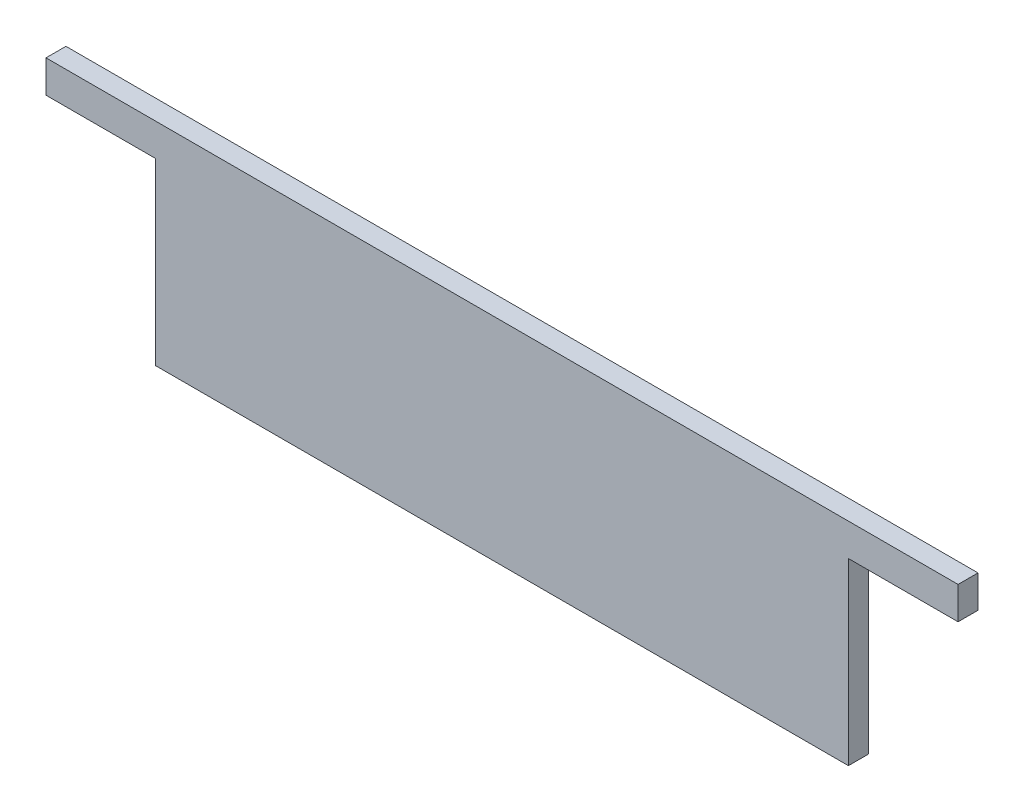
ISO-10303-21;
HEADER;
FILE_DESCRIPTION(('STEP AP214'),'2;1');
FILE_NAME('part.step','',(''),(''),'','','');
FILE_SCHEMA(('AUTOMOTIVE_DESIGN { 1 0 10303 214 1 1 1 1 }'));
ENDSEC;
DATA;
#1=APPLICATION_CONTEXT('core data for automotive mechanical design processes');
#2=APPLICATION_PROTOCOL_DEFINITION('international standard','automotive_design',2000,#1);
#3=PRODUCT_CONTEXT('',#1,'mechanical');
#4=PRODUCT('Part','Part','',(#3));
#5=PRODUCT_RELATED_PRODUCT_CATEGORY('part','',(#4));
#6=PRODUCT_DEFINITION_FORMATION('','',#4);
#7=PRODUCT_DEFINITION_CONTEXT('part definition',#1,'design');
#8=PRODUCT_DEFINITION('design','',#6,#7);
#9=PRODUCT_DEFINITION_SHAPE('','',#8);
#10=(LENGTH_UNIT() NAMED_UNIT(*) SI_UNIT(.MILLI.,.METRE.));
#11=(NAMED_UNIT(*) PLANE_ANGLE_UNIT() SI_UNIT($,.RADIAN.));
#12=(NAMED_UNIT(*) SI_UNIT($,.STERADIAN.) SOLID_ANGLE_UNIT());
#13=UNCERTAINTY_MEASURE_WITH_UNIT(LENGTH_MEASURE(1.E-05),#10,'distance_accuracy_value','');
#14=(GEOMETRIC_REPRESENTATION_CONTEXT(3) GLOBAL_UNCERTAINTY_ASSIGNED_CONTEXT((#13)) GLOBAL_UNIT_ASSIGNED_CONTEXT((#10,
#11,#12)) REPRESENTATION_CONTEXT('',''));
#15=CARTESIAN_POINT('',(0.,0.,0.));
#16=DIRECTION('',(0.,0.,1.));
#17=DIRECTION('',(1.,0.,0.));
#18=AXIS2_PLACEMENT_3D('',#15,#16,#17);
#19=CARTESIAN_POINT('',(0.,134.9375,0.));
#20=DIRECTION('',(0.,0.,1.));
#21=DIRECTION('',(1.,0.,0.));
#22=AXIS2_PLACEMENT_3D('',#19,#20,#21);
#23=PLANE('',#22);
#24=DIRECTION('',(1.,0.,0.));
#25=VECTOR('',#24,1.);
#26=CARTESIAN_POINT('',(0.,0.,0.));
#27=LINE('',#26,#25);
#28=CARTESIAN_POINT('',(511.175,0.,0.));
#29=VERTEX_POINT('',#28);
#30=CARTESIAN_POINT('',(69.85,0.,0.));
#31=VERTEX_POINT('',#30);
#32=EDGE_CURVE('E20',#29,#31,#27,.F.);
#33=ORIENTED_EDGE('',*,*,#32,.F.);
#34=DIRECTION('',(0.,1.,0.));
#35=VECTOR('',#34,1.);
#36=CARTESIAN_POINT('',(511.175,0.,0.));
#37=LINE('',#36,#35);
#38=CARTESIAN_POINT('',(511.175,114.3,0.));
#39=VERTEX_POINT('',#38);
#40=EDGE_CURVE('E124',#29,#39,#37,.T.);
#41=ORIENTED_EDGE('',*,*,#40,.T.);
#42=DIRECTION('',(1.,0.,0.));
#43=VECTOR('',#42,1.);
#44=CARTESIAN_POINT('',(511.175,114.3,0.));
#45=LINE('',#44,#43);
#46=CARTESIAN_POINT('',(581.025,114.3,0.));
#47=VERTEX_POINT('',#46);
#48=EDGE_CURVE('E119',#39,#47,#45,.T.);
#49=ORIENTED_EDGE('',*,*,#48,.T.);
#50=DIRECTION('',(0.,1.,0.));
#51=VECTOR('',#50,1.);
#52=CARTESIAN_POINT('',(581.025,0.,0.));
#53=LINE('',#52,#51);
#54=CARTESIAN_POINT('',(581.025,134.9375,0.));
#55=VERTEX_POINT('',#54);
#56=EDGE_CURVE('E116',#55,#47,#53,.F.);
#57=ORIENTED_EDGE('',*,*,#56,.F.);
#58=DIRECTION('',(1.,0.,0.));
#59=VECTOR('',#58,1.);
#60=CARTESIAN_POINT('',(0.,134.9375,0.));
#61=LINE('',#60,#59);
#62=CARTESIAN_POINT('',(0.,134.9375,0.));
#63=VERTEX_POINT('',#62);
#64=EDGE_CURVE('E108',#63,#55,#61,.T.);
#65=ORIENTED_EDGE('',*,*,#64,.F.);
#66=DIRECTION('',(0.,1.,0.));
#67=VECTOR('',#66,1.);
#68=CARTESIAN_POINT('',(0.,0.,0.));
#69=LINE('',#68,#67);
#70=CARTESIAN_POINT('',(0.,114.3,0.));
#71=VERTEX_POINT('',#70);
#72=EDGE_CURVE('E106',#63,#71,#69,.F.);
#73=ORIENTED_EDGE('',*,*,#72,.T.);
#74=DIRECTION('',(1.,0.,0.));
#75=VECTOR('',#74,1.);
#76=CARTESIAN_POINT('',(0.,114.3,0.));
#77=LINE('',#76,#75);
#78=CARTESIAN_POINT('',(69.85,114.3,0.));
#79=VERTEX_POINT('',#78);
#80=EDGE_CURVE('E80',#71,#79,#77,.T.);
#81=ORIENTED_EDGE('',*,*,#80,.T.);
#82=DIRECTION('',(0.,1.,0.));
#83=VECTOR('',#82,1.);
#84=CARTESIAN_POINT('',(69.85,114.3,0.));
#85=LINE('',#84,#83);
#86=EDGE_CURVE('E92',#79,#31,#85,.F.);
#87=ORIENTED_EDGE('',*,*,#86,.T.);
#88=EDGE_LOOP('',(#33,#41,#49,#57,#65,#73,#81,#87));
#89=FACE_BOUND('',#88,.T.);
#90=ADVANCED_FACE('F17',(#89),#23,.T.);
#91=CARTESIAN_POINT('',(0.,0.,0.));
#92=DIRECTION('',(0.,-1.,0.));
#93=DIRECTION('',(0.,0.,-1.));
#94=AXIS2_PLACEMENT_3D('',#91,#92,#93);
#95=PLANE('',#94);
#96=DIRECTION('',(-1.,0.,0.));
#97=VECTOR('',#96,1.);
#98=CARTESIAN_POINT('',(0.,0.,-12.7));
#99=LINE('',#98,#97);
#100=CARTESIAN_POINT('',(511.175,0.,-12.7));
#101=VERTEX_POINT('',#100);
#102=CARTESIAN_POINT('',(69.85,0.,-12.7));
#103=VERTEX_POINT('',#102);
#104=EDGE_CURVE('E127',#101,#103,#99,.T.);
#105=ORIENTED_EDGE('',*,*,#104,.F.);
#106=DIRECTION('',(0.,0.,1.));
#107=VECTOR('',#106,1.);
#108=CARTESIAN_POINT('',(511.175,0.,-12.7));
#109=LINE('',#108,#107);
#110=EDGE_CURVE('E90',#101,#29,#109,.T.);
#111=ORIENTED_EDGE('',*,*,#110,.T.);
#112=ORIENTED_EDGE('',*,*,#32,.T.);
#113=DIRECTION('',(0.,0.,-1.));
#114=VECTOR('',#113,1.);
#115=CARTESIAN_POINT('',(69.85,0.,-12.7));
#116=LINE('',#115,#114);
#117=EDGE_CURVE('E87',#31,#103,#116,.T.);
#118=ORIENTED_EDGE('',*,*,#117,.T.);
#119=EDGE_LOOP('',(#105,#111,#112,#118));
#120=FACE_BOUND('',#119,.T.);
#121=ADVANCED_FACE('F85',(#120),#95,.T.);
#122=CARTESIAN_POINT('',(69.85,114.3,-12.7));
#123=DIRECTION('',(1.,0.,0.));
#124=DIRECTION('',(0.,0.,-1.));
#125=AXIS2_PLACEMENT_3D('',#122,#123,#124);
#126=PLANE('',#125);
#127=DIRECTION('',(0.,0.,1.));
#128=VECTOR('',#127,1.);
#129=CARTESIAN_POINT('',(69.85,114.3,-12.7));
#130=LINE('',#129,#128);
#131=CARTESIAN_POINT('',(69.85,114.3,-12.7));
#132=VERTEX_POINT('',#131);
#133=EDGE_CURVE('E102',#79,#132,#130,.F.);
#134=ORIENTED_EDGE('',*,*,#133,.T.);
#135=DIRECTION('',(0.,1.,0.));
#136=VECTOR('',#135,1.);
#137=CARTESIAN_POINT('',(69.85,0.,-12.7));
#138=LINE('',#137,#136);
#139=EDGE_CURVE('E98',#103,#132,#138,.T.);
#140=ORIENTED_EDGE('',*,*,#139,.F.);
#141=ORIENTED_EDGE('',*,*,#117,.F.);
#142=ORIENTED_EDGE('',*,*,#86,.F.);
#143=EDGE_LOOP('',(#134,#140,#141,#142));
#144=FACE_BOUND('',#143,.T.);
#145=ADVANCED_FACE('F96',(#144),#126,.F.);
#146=CARTESIAN_POINT('',(0.,114.3,-12.7));
#147=DIRECTION('',(0.,1.,0.));
#148=DIRECTION('',(0.,0.,1.));
#149=AXIS2_PLACEMENT_3D('',#146,#147,#148);
#150=PLANE('',#149);
#151=ORIENTED_EDGE('',*,*,#80,.F.);
#152=DIRECTION('',(0.,0.,-1.));
#153=VECTOR('',#152,1.);
#154=CARTESIAN_POINT('',(0.,114.3,0.));
#155=LINE('',#154,#153);
#156=CARTESIAN_POINT('',(0.,114.3,-12.7));
#157=VERTEX_POINT('',#156);
#158=EDGE_CURVE('E104',#71,#157,#155,.T.);
#159=ORIENTED_EDGE('',*,*,#158,.T.);
#160=DIRECTION('',(-1.,0.,0.));
#161=VECTOR('',#160,1.);
#162=CARTESIAN_POINT('',(0.,114.3,-12.7));
#163=LINE('',#162,#161);
#164=EDGE_CURVE('E130',#132,#157,#163,.T.);
#165=ORIENTED_EDGE('',*,*,#164,.F.);
#166=ORIENTED_EDGE('',*,*,#133,.F.);
#167=EDGE_LOOP('',(#151,#159,#165,#166));
#168=FACE_BOUND('',#167,.T.);
#169=ADVANCED_FACE('F173',(#168),#150,.F.);
#170=CARTESIAN_POINT('',(0.,0.,0.));
#171=DIRECTION('',(1.,0.,0.));
#172=DIRECTION('',(0.,0.,-1.));
#173=AXIS2_PLACEMENT_3D('',#170,#171,#172);
#174=PLANE('',#173);
#175=DIRECTION('',(0.,0.,1.));
#176=VECTOR('',#175,1.);
#177=CARTESIAN_POINT('',(0.,134.9375,-12.7));
#178=LINE('',#177,#176);
#179=CARTESIAN_POINT('',(0.,134.9375,-12.7));
#180=VERTEX_POINT('',#179);
#181=EDGE_CURVE('E110',#180,#63,#178,.T.);
#182=ORIENTED_EDGE('',*,*,#181,.F.);
#183=DIRECTION('',(0.,1.,0.));
#184=VECTOR('',#183,1.);
#185=CARTESIAN_POINT('',(0.,0.,-12.7));
#186=LINE('',#185,#184);
#187=EDGE_CURVE('E133',#157,#180,#186,.T.);
#188=ORIENTED_EDGE('',*,*,#187,.F.);
#189=ORIENTED_EDGE('',*,*,#158,.F.);
#190=ORIENTED_EDGE('',*,*,#72,.F.);
#191=EDGE_LOOP('',(#182,#188,#189,#190));
#192=FACE_BOUND('',#191,.T.);
#193=ADVANCED_FACE('F169',(#192),#174,.F.);
#194=CARTESIAN_POINT('',(0.,134.9375,-12.7));
#195=DIRECTION('',(0.,1.,0.));
#196=DIRECTION('',(0.,0.,1.));
#197=AXIS2_PLACEMENT_3D('',#194,#195,#196);
#198=PLANE('',#197);
#199=DIRECTION('',(-1.,0.,0.));
#200=VECTOR('',#199,1.);
#201=CARTESIAN_POINT('',(0.,134.9375,-12.7));
#202=LINE('',#201,#200);
#203=CARTESIAN_POINT('',(581.025,134.9375,-12.7));
#204=VERTEX_POINT('',#203);
#205=EDGE_CURVE('E136',#180,#204,#202,.F.);
#206=ORIENTED_EDGE('',*,*,#205,.F.);
#207=ORIENTED_EDGE('',*,*,#181,.T.);
#208=ORIENTED_EDGE('',*,*,#64,.T.);
#209=DIRECTION('',(0.,0.,-1.));
#210=VECTOR('',#209,1.);
#211=CARTESIAN_POINT('',(581.025,134.9375,0.));
#212=LINE('',#211,#210);
#213=EDGE_CURVE('E113',#204,#55,#212,.F.);
#214=ORIENTED_EDGE('',*,*,#213,.F.);
#215=EDGE_LOOP('',(#206,#207,#208,#214));
#216=FACE_BOUND('',#215,.T.);
#217=ADVANCED_FACE('F166',(#216),#198,.T.);
#218=CARTESIAN_POINT('',(581.025,0.,0.));
#219=DIRECTION('',(1.,0.,0.));
#220=DIRECTION('',(0.,0.,-1.));
#221=AXIS2_PLACEMENT_3D('',#218,#219,#220);
#222=PLANE('',#221);
#223=ORIENTED_EDGE('',*,*,#56,.T.);
#224=DIRECTION('',(0.,0.,1.));
#225=VECTOR('',#224,1.);
#226=CARTESIAN_POINT('',(581.025,114.3,-12.7));
#227=LINE('',#226,#225);
#228=CARTESIAN_POINT('',(581.025,114.3,-12.7));
#229=VERTEX_POINT('',#228);
#230=EDGE_CURVE('E121',#47,#229,#227,.F.);
#231=ORIENTED_EDGE('',*,*,#230,.T.);
#232=DIRECTION('',(0.,1.,0.));
#233=VECTOR('',#232,1.);
#234=CARTESIAN_POINT('',(581.025,0.,-12.7));
#235=LINE('',#234,#233);
#236=EDGE_CURVE('E139',#204,#229,#235,.F.);
#237=ORIENTED_EDGE('',*,*,#236,.F.);
#238=ORIENTED_EDGE('',*,*,#213,.T.);
#239=EDGE_LOOP('',(#223,#231,#237,#238));
#240=FACE_BOUND('',#239,.T.);
#241=ADVANCED_FACE('F149',(#240),#222,.T.);
#242=CARTESIAN_POINT('',(511.175,114.3,-12.7));
#243=DIRECTION('',(0.,1.,0.));
#244=DIRECTION('',(0.,0.,1.));
#245=AXIS2_PLACEMENT_3D('',#242,#243,#244);
#246=PLANE('',#245);
#247=ORIENTED_EDGE('',*,*,#48,.F.);
#248=DIRECTION('',(0.,0.,1.));
#249=VECTOR('',#248,1.);
#250=CARTESIAN_POINT('',(511.175,114.3,-12.7));
#251=LINE('',#250,#249);
#252=CARTESIAN_POINT('',(511.175,114.3,-12.7));
#253=VERTEX_POINT('',#252);
#254=EDGE_CURVE('E35',#39,#253,#251,.F.);
#255=ORIENTED_EDGE('',*,*,#254,.T.);
#256=DIRECTION('',(-1.,0.,0.));
#257=VECTOR('',#256,1.);
#258=CARTESIAN_POINT('',(0.,114.3,-12.7));
#259=LINE('',#258,#257);
#260=EDGE_CURVE('E26',#229,#253,#259,.T.);
#261=ORIENTED_EDGE('',*,*,#260,.F.);
#262=ORIENTED_EDGE('',*,*,#230,.F.);
#263=EDGE_LOOP('',(#247,#255,#261,#262));
#264=FACE_BOUND('',#263,.T.);
#265=ADVANCED_FACE('F147',(#264),#246,.F.);
#266=CARTESIAN_POINT('',(511.175,0.,-12.7));
#267=DIRECTION('',(-1.,0.,0.));
#268=DIRECTION('',(0.,0.,1.));
#269=AXIS2_PLACEMENT_3D('',#266,#267,#268);
#270=PLANE('',#269);
#271=ORIENTED_EDGE('',*,*,#254,.F.);
#272=ORIENTED_EDGE('',*,*,#40,.F.);
#273=ORIENTED_EDGE('',*,*,#110,.F.);
#274=DIRECTION('',(0.,1.,0.));
#275=VECTOR('',#274,1.);
#276=CARTESIAN_POINT('',(511.175,0.,-12.7));
#277=LINE('',#276,#275);
#278=EDGE_CURVE('E11',#253,#101,#277,.F.);
#279=ORIENTED_EDGE('',*,*,#278,.F.);
#280=EDGE_LOOP('',(#271,#272,#273,#279));
#281=FACE_BOUND('',#280,.T.);
#282=ADVANCED_FACE('F153',(#281),#270,.F.);
#283=CARTESIAN_POINT('',(0.,0.,-12.7));
#284=DIRECTION('',(0.,0.,-1.));
#285=DIRECTION('',(-1.,0.,0.));
#286=AXIS2_PLACEMENT_3D('',#283,#284,#285);
#287=PLANE('',#286);
#288=ORIENTED_EDGE('',*,*,#260,.T.);
#289=ORIENTED_EDGE('',*,*,#278,.T.);
#290=ORIENTED_EDGE('',*,*,#104,.T.);
#291=ORIENTED_EDGE('',*,*,#139,.T.);
#292=ORIENTED_EDGE('',*,*,#164,.T.);
#293=ORIENTED_EDGE('',*,*,#187,.T.);
#294=ORIENTED_EDGE('',*,*,#205,.T.);
#295=ORIENTED_EDGE('',*,*,#236,.T.);
#296=EDGE_LOOP('',(#288,#289,#290,#291,#292,#293,#294,#295));
#297=FACE_BOUND('',#296,.T.);
#298=ADVANCED_FACE('F144',(#297),#287,.T.);
#299=CLOSED_SHELL('',(#90,#121,#145,#169,#193,#217,#241,#265,#282,#298));
#300=MANIFOLD_SOLID_BREP('B1',#299);
#301=ADVANCED_BREP_SHAPE_REPRESENTATION('',(#18,#300),#14);
#302=SHAPE_DEFINITION_REPRESENTATION(#9,#301);
ENDSEC;
END-ISO-10303-21;
